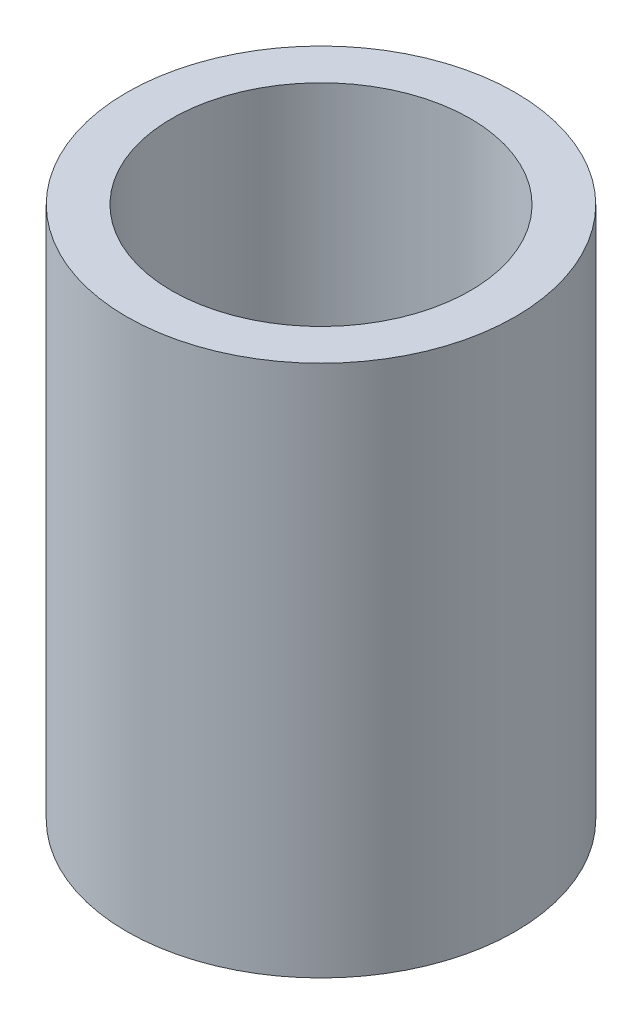
ISO-10303-21;
HEADER;
FILE_DESCRIPTION(('STEP AP214'),'2;1');
FILE_NAME('part.step','',(''),(''),'','','');
FILE_SCHEMA(('AUTOMOTIVE_DESIGN { 1 0 10303 214 1 1 1 1 }'));
ENDSEC;
DATA;
#1=APPLICATION_CONTEXT('core data for automotive mechanical design processes');
#2=APPLICATION_PROTOCOL_DEFINITION('international standard','automotive_design',2000,#1);
#3=PRODUCT_CONTEXT('',#1,'mechanical');
#4=PRODUCT('Part','Part','',(#3));
#5=PRODUCT_RELATED_PRODUCT_CATEGORY('part','',(#4));
#6=PRODUCT_DEFINITION_FORMATION('','',#4);
#7=PRODUCT_DEFINITION_CONTEXT('part definition',#1,'design');
#8=PRODUCT_DEFINITION('design','',#6,#7);
#9=PRODUCT_DEFINITION_SHAPE('','',#8);
#10=(LENGTH_UNIT() NAMED_UNIT(*) SI_UNIT(.MILLI.,.METRE.));
#11=(NAMED_UNIT(*) PLANE_ANGLE_UNIT() SI_UNIT($,.RADIAN.));
#12=(NAMED_UNIT(*) SI_UNIT($,.STERADIAN.) SOLID_ANGLE_UNIT());
#13=UNCERTAINTY_MEASURE_WITH_UNIT(LENGTH_MEASURE(1.E-05),#10,'distance_accuracy_value','');
#14=(GEOMETRIC_REPRESENTATION_CONTEXT(3) GLOBAL_UNCERTAINTY_ASSIGNED_CONTEXT((#13)) GLOBAL_UNIT_ASSIGNED_CONTEXT((#10,
#11,#12)) REPRESENTATION_CONTEXT('',''));
#15=CARTESIAN_POINT('',(0.,0.,0.));
#16=DIRECTION('',(0.,0.,1.));
#17=DIRECTION('',(1.,0.,0.));
#18=AXIS2_PLACEMENT_3D('',#15,#16,#17);
#19=CARTESIAN_POINT('',(0.,54.805818981143,0.));
#20=DIRECTION('',(0.,-1.,0.));
#21=DIRECTION('',(0.,0.,-1.));
#22=AXIS2_PLACEMENT_3D('',#19,#20,#21);
#23=CYLINDRICAL_SURFACE('',#22,20.);
#24=CARTESIAN_POINT('',(0.,54.805818981143,0.));
#25=DIRECTION('',(0.,1.,0.));
#26=DIRECTION('',(0.,0.,1.));
#27=AXIS2_PLACEMENT_3D('',#24,#25,#26);
#28=CIRCLE('',#27,20.);
#29=CARTESIAN_POINT('',(0.,54.805818981143,20.));
#30=VERTEX_POINT('',#29);
#31=EDGE_CURVE('E10',#30,#30,#28,.T.);
#32=ORIENTED_EDGE('',*,*,#31,.F.);
#33=EDGE_LOOP('',(#32));
#34=FACE_BOUND('',#33,.T.);
#35=CARTESIAN_POINT('',(0.,0.,0.));
#36=DIRECTION('',(0.,1.,0.));
#37=DIRECTION('',(0.,0.,1.));
#38=AXIS2_PLACEMENT_3D('',#35,#36,#37);
#39=CIRCLE('',#38,20.);
#40=CARTESIAN_POINT('',(0.,0.,20.));
#41=VERTEX_POINT('',#40);
#42=EDGE_CURVE('E37',#41,#41,#39,.T.);
#43=ORIENTED_EDGE('',*,*,#42,.T.);
#44=EDGE_LOOP('',(#43));
#45=FACE_BOUND('',#44,.T.);
#46=ADVANCED_FACE('F40',(#34,#45),#23,.T.);
#47=CARTESIAN_POINT('',(0.,54.805818981143,0.));
#48=DIRECTION('',(0.,1.,0.));
#49=DIRECTION('',(0.,0.,1.));
#50=AXIS2_PLACEMENT_3D('',#47,#48,#49);
#51=PLANE('',#50);
#52=CARTESIAN_POINT('',(0.,54.805818981143,0.));
#53=DIRECTION('',(0.,1.,0.));
#54=DIRECTION('',(0.,0.,1.));
#55=AXIS2_PLACEMENT_3D('',#52,#53,#54);
#56=CIRCLE('',#55,15.3643864919456);
#57=CARTESIAN_POINT('',(0.,54.805818981143,15.3643864919456));
#58=VERTEX_POINT('',#57);
#59=EDGE_CURVE('E50',#58,#58,#56,.T.);
#60=ORIENTED_EDGE('',*,*,#59,.F.);
#61=EDGE_LOOP('',(#60));
#62=FACE_BOUND('',#61,.T.);
#63=ORIENTED_EDGE('',*,*,#31,.T.);
#64=EDGE_LOOP('',(#63));
#65=FACE_BOUND('',#64,.T.);
#66=ADVANCED_FACE('F59',(#62,#65),#51,.T.);
#67=CARTESIAN_POINT('',(0.,0.,0.));
#68=DIRECTION('',(0.,1.,0.));
#69=DIRECTION('',(0.,0.,1.));
#70=AXIS2_PLACEMENT_3D('',#67,#68,#69);
#71=PLANE('',#70);
#72=CARTESIAN_POINT('',(0.,0.,0.));
#73=DIRECTION('',(0.,1.,0.));
#74=DIRECTION('',(0.,0.,1.));
#75=AXIS2_PLACEMENT_3D('',#72,#73,#74);
#76=CIRCLE('',#75,15.3643864919456);
#77=CARTESIAN_POINT('',(0.,0.,15.3643864919456));
#78=VERTEX_POINT('',#77);
#79=EDGE_CURVE('E47',#78,#78,#76,.T.);
#80=ORIENTED_EDGE('',*,*,#79,.T.);
#81=EDGE_LOOP('',(#80));
#82=FACE_BOUND('',#81,.T.);
#83=ORIENTED_EDGE('',*,*,#42,.F.);
#84=EDGE_LOOP('',(#83));
#85=FACE_BOUND('',#84,.T.);
#86=ADVANCED_FACE('F58',(#82,#85),#71,.F.);
#87=CARTESIAN_POINT('',(0.,54.805818981143,0.));
#88=DIRECTION('',(0.,-1.,0.));
#89=DIRECTION('',(0.,0.,-1.));
#90=AXIS2_PLACEMENT_3D('',#87,#88,#89);
#91=CYLINDRICAL_SURFACE('',#90,15.3643864919456);
#92=ORIENTED_EDGE('',*,*,#59,.T.);
#93=EDGE_LOOP('',(#92));
#94=FACE_BOUND('',#93,.T.);
#95=ORIENTED_EDGE('',*,*,#79,.F.);
#96=EDGE_LOOP('',(#95));
#97=FACE_BOUND('',#96,.T.);
#98=ADVANCED_FACE('F54',(#94,#97),#91,.F.);
#99=CLOSED_SHELL('',(#46,#66,#86,#98));
#100=MANIFOLD_SOLID_BREP('B2',#99);
#101=ADVANCED_BREP_SHAPE_REPRESENTATION('',(#18,#100),#14);
#102=SHAPE_DEFINITION_REPRESENTATION(#9,#101);
ENDSEC;
END-ISO-10303-21;
